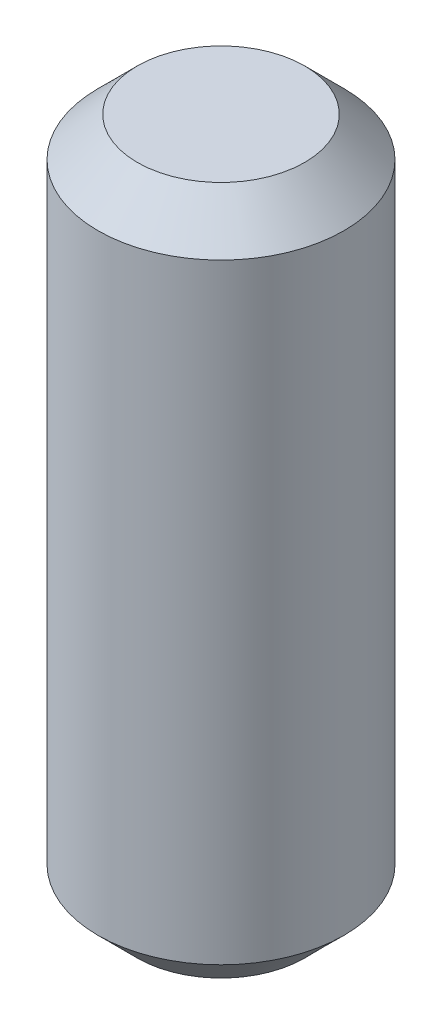
ISO-10303-21;
HEADER;
FILE_DESCRIPTION(('STEP AP214'),'2;1');
FILE_NAME('part.step','',(''),(''),'','','');
FILE_SCHEMA(('AUTOMOTIVE_DESIGN { 1 0 10303 214 1 1 1 1 }'));
ENDSEC;
DATA;
#1=APPLICATION_CONTEXT('core data for automotive mechanical design processes');
#2=APPLICATION_PROTOCOL_DEFINITION('international standard','automotive_design',2000,#1);
#3=PRODUCT_CONTEXT('',#1,'mechanical');
#4=PRODUCT('Part','Part','',(#3));
#5=PRODUCT_RELATED_PRODUCT_CATEGORY('part','',(#4));
#6=PRODUCT_DEFINITION_FORMATION('','',#4);
#7=PRODUCT_DEFINITION_CONTEXT('part definition',#1,'design');
#8=PRODUCT_DEFINITION('design','',#6,#7);
#9=PRODUCT_DEFINITION_SHAPE('','',#8);
#10=(LENGTH_UNIT() NAMED_UNIT(*) SI_UNIT(.MILLI.,.METRE.));
#11=(NAMED_UNIT(*) PLANE_ANGLE_UNIT() SI_UNIT($,.RADIAN.));
#12=(NAMED_UNIT(*) SI_UNIT($,.STERADIAN.) SOLID_ANGLE_UNIT());
#13=UNCERTAINTY_MEASURE_WITH_UNIT(LENGTH_MEASURE(1.E-05),#10,'distance_accuracy_value','');
#14=(GEOMETRIC_REPRESENTATION_CONTEXT(3) GLOBAL_UNCERTAINTY_ASSIGNED_CONTEXT((#13)) GLOBAL_UNIT_ASSIGNED_CONTEXT((#10,
#11,#12)) REPRESENTATION_CONTEXT('',''));
#15=CARTESIAN_POINT('',(0.,0.,0.));
#16=DIRECTION('',(0.,0.,1.));
#17=DIRECTION('',(1.,0.,0.));
#18=AXIS2_PLACEMENT_3D('',#15,#16,#17);
#19=CARTESIAN_POINT('',(0.,-14.,0.));
#20=DIRECTION('',(0.,1.,0.));
#21=DIRECTION('',(0.,0.,1.));
#22=AXIS2_PLACEMENT_3D('',#19,#20,#21);
#23=PLANE('',#22);
#24=CARTESIAN_POINT('',(0.,-14.00000000001,0.));
#25=DIRECTION('',(0.,1.,0.));
#26=DIRECTION('',(-1.,0.,0.));
#27=AXIS2_PLACEMENT_3D('',#24,#25,#26);
#28=CIRCLE('',#27,1.70000000002801);
#29=CARTESIAN_POINT('',(-1.70000000002801,-14.00000000001,0.));
#30=VERTEX_POINT('',#29);
#31=EDGE_CURVE('E17',#30,#30,#28,.T.);
#32=ORIENTED_EDGE('',*,*,#31,.F.);
#33=EDGE_LOOP('',(#32));
#34=FACE_BOUND('',#33,.T.);
#35=ADVANCED_FACE('F14',(#34),#23,.F.);
#36=CARTESIAN_POINT('',(0.,0.,0.));
#37=DIRECTION('',(0.,1.,0.));
#38=DIRECTION('',(0.,0.,1.));
#39=AXIS2_PLACEMENT_3D('',#36,#37,#38);
#40=PLANE('',#39);
#41=CARTESIAN_POINT('',(0.,1.13686837721616E-10,0.));
#42=DIRECTION('',(0.,-1.,0.));
#43=DIRECTION('',(0.,0.,-1.));
#44=AXIS2_PLACEMENT_3D('',#41,#42,#43);
#45=CIRCLE('',#44,1.70000000002801);
#46=CARTESIAN_POINT('',(0.,1.13686837721616E-10,-1.70000000002801));
#47=VERTEX_POINT('',#46);
#48=EDGE_CURVE('E26',#47,#47,#45,.T.);
#49=ORIENTED_EDGE('',*,*,#48,.F.);
#50=EDGE_LOOP('',(#49));
#51=FACE_BOUND('',#50,.T.);
#52=ADVANCED_FACE('F38',(#51),#40,.T.);
#53=CARTESIAN_POINT('',(0.,-13.2000000000403,0.));
#54=DIRECTION('',(0.,1.,0.));
#55=DIRECTION('',(-1.,0.,0.));
#56=AXIS2_PLACEMENT_3D('',#53,#54,#55);
#57=CONICAL_SURFACE('',#56,2.49999999999773,0.785398163397448);
#58=ORIENTED_EDGE('',*,*,#31,.T.);
#59=EDGE_LOOP('',(#58));
#60=FACE_BOUND('',#59,.T.);
#61=CARTESIAN_POINT('',(0.,-13.2,0.));
#62=DIRECTION('',(0.,1.,0.));
#63=DIRECTION('',(0.,0.,1.));
#64=AXIS2_PLACEMENT_3D('',#61,#62,#63);
#65=CIRCLE('',#64,2.5);
#66=CARTESIAN_POINT('',(0.,-13.2,2.5));
#67=VERTEX_POINT('',#66);
#68=EDGE_CURVE('E21',#67,#67,#65,.T.);
#69=ORIENTED_EDGE('',*,*,#68,.F.);
#70=EDGE_LOOP('',(#69));
#71=FACE_BOUND('',#70,.T.);
#72=ADVANCED_FACE('F34',(#60,#71),#57,.T.);
#73=CARTESIAN_POINT('',(0.,-0.799999999856027,0.));
#74=DIRECTION('',(0.,-1.,0.));
#75=DIRECTION('',(0.,0.,-1.));
#76=AXIS2_PLACEMENT_3D('',#73,#74,#75);
#77=CONICAL_SURFACE('',#76,2.49999999999773,0.785398163397448);
#78=CARTESIAN_POINT('',(0.,-0.800000000000023,0.));
#79=DIRECTION('',(0.,1.,0.));
#80=DIRECTION('',(0.,0.,1.));
#81=AXIS2_PLACEMENT_3D('',#78,#79,#80);
#82=CIRCLE('',#81,2.5);
#83=CARTESIAN_POINT('',(0.,-0.800000000000023,2.5));
#84=VERTEX_POINT('',#83);
#85=EDGE_CURVE('E10',#84,#84,#82,.F.);
#86=ORIENTED_EDGE('',*,*,#85,.F.);
#87=EDGE_LOOP('',(#86));
#88=FACE_BOUND('',#87,.T.);
#89=ORIENTED_EDGE('',*,*,#48,.T.);
#90=EDGE_LOOP('',(#89));
#91=FACE_BOUND('',#90,.T.);
#92=ADVANCED_FACE('F46',(#88,#91),#77,.T.);
#93=CARTESIAN_POINT('',(0.,-14.7,0.));
#94=DIRECTION('',(0.,1.,0.));
#95=DIRECTION('',(0.,0.,1.));
#96=AXIS2_PLACEMENT_3D('',#93,#94,#95);
#97=CYLINDRICAL_SURFACE('',#96,2.5);
#98=ORIENTED_EDGE('',*,*,#85,.T.);
#99=EDGE_LOOP('',(#98));
#100=FACE_BOUND('',#99,.T.);
#101=ORIENTED_EDGE('',*,*,#68,.T.);
#102=EDGE_LOOP('',(#101));
#103=FACE_BOUND('',#102,.T.);
#104=ADVANCED_FACE('F44',(#100,#103),#97,.T.);
#105=CLOSED_SHELL('',(#35,#52,#72,#92,#104));
#106=MANIFOLD_SOLID_BREP('B1',#105);
#107=ADVANCED_BREP_SHAPE_REPRESENTATION('',(#18,#106),#14);
#108=SHAPE_DEFINITION_REPRESENTATION(#9,#107);
ENDSEC;
END-ISO-10303-21;
